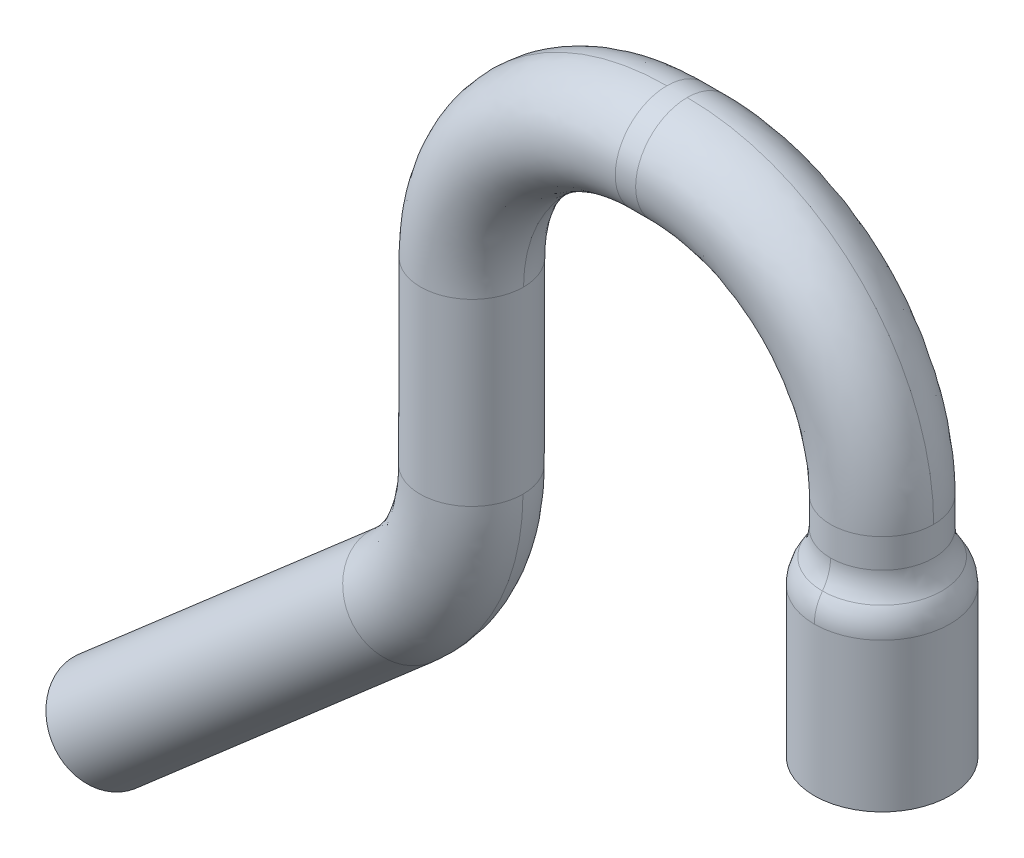
ISO-10303-21;
HEADER;
FILE_DESCRIPTION(('STEP AP214'),'2;1');
FILE_NAME('part.step','',(''),(''),'','','');
FILE_SCHEMA(('AUTOMOTIVE_DESIGN { 1 0 10303 214 1 1 1 1 }'));
ENDSEC;
DATA;
#1=APPLICATION_CONTEXT('core data for automotive mechanical design processes');
#2=APPLICATION_PROTOCOL_DEFINITION('international standard','automotive_design',2000,#1);
#3=PRODUCT_CONTEXT('',#1,'mechanical');
#4=PRODUCT('Part','Part','',(#3));
#5=PRODUCT_RELATED_PRODUCT_CATEGORY('part','',(#4));
#6=PRODUCT_DEFINITION_FORMATION('','',#4);
#7=PRODUCT_DEFINITION_CONTEXT('part definition',#1,'design');
#8=PRODUCT_DEFINITION('design','',#6,#7);
#9=PRODUCT_DEFINITION_SHAPE('','',#8);
#10=(LENGTH_UNIT() NAMED_UNIT(*) SI_UNIT(.MILLI.,.METRE.));
#11=(NAMED_UNIT(*) PLANE_ANGLE_UNIT() SI_UNIT($,.RADIAN.));
#12=(NAMED_UNIT(*) SI_UNIT($,.STERADIAN.) SOLID_ANGLE_UNIT());
#13=UNCERTAINTY_MEASURE_WITH_UNIT(LENGTH_MEASURE(1.E-05),#10,'distance_accuracy_value','');
#14=(GEOMETRIC_REPRESENTATION_CONTEXT(3) GLOBAL_UNCERTAINTY_ASSIGNED_CONTEXT((#13)) GLOBAL_UNIT_ASSIGNED_CONTEXT((#10,
#11,#12)) REPRESENTATION_CONTEXT('',''));
#15=CARTESIAN_POINT('',(0.,0.,0.));
#16=DIRECTION('',(0.,0.,1.));
#17=DIRECTION('',(1.,0.,0.));
#18=AXIS2_PLACEMENT_3D('',#15,#16,#17);
#19=CARTESIAN_POINT('',(-3.2131,155.5,3.2131));
#20=DIRECTION('',(0.,-1.,0.));
#21=DIRECTION('',(0.,0.,-1.));
#22=AXIS2_PLACEMENT_3D('',#19,#20,#21);
#23=PLANE('',#22);
#24=CARTESIAN_POINT('',(0.,155.5,0.));
#25=DIRECTION('',(0.,-1.,0.));
#26=DIRECTION('',(1.,0.,0.));
#27=AXIS2_PLACEMENT_3D('',#24,#25,#26);
#28=CIRCLE('',#27,3.175);
#29=CARTESIAN_POINT('',(3.175,155.5,0.));
#30=VERTEX_POINT('',#29);
#31=EDGE_CURVE('E20',#30,#30,#28,.F.);
#32=ORIENTED_EDGE('',*,*,#31,.F.);
#33=EDGE_LOOP('',(#32));
#34=FACE_BOUND('',#33,.T.);
#35=ADVANCED_FACE('F16',(#34),#23,.T.);
#36=CARTESIAN_POINT('',(0.,155.5,0.));
#37=DIRECTION('',(0.,-1.,0.));
#38=DIRECTION('',(1.,0.,0.));
#39=AXIS2_PLACEMENT_3D('',#36,#37,#38);
#40=CYLINDRICAL_SURFACE('',#39,3.175);
#41=CARTESIAN_POINT('',(0.,145.34,0.));
#42=DIRECTION('',(0.,-1.,0.));
#43=DIRECTION('',(1.,0.,0.));
#44=AXIS2_PLACEMENT_3D('',#41,#42,#43);
#45=CIRCLE('',#44,3.175);
#46=CARTESIAN_POINT('',(3.17499999999996,145.34,0.));
#47=VERTEX_POINT('',#46);
#48=EDGE_CURVE('E234',#47,#47,#45,.F.);
#49=ORIENTED_EDGE('',*,*,#48,.F.);
#50=EDGE_LOOP('',(#49));
#51=FACE_BOUND('',#50,.T.);
#52=ORIENTED_EDGE('',*,*,#31,.T.);
#53=EDGE_LOOP('',(#52));
#54=FACE_BOUND('',#53,.T.);
#55=ADVANCED_FACE('F241',(#51,#54),#40,.F.);
#56=CARTESIAN_POINT('',(-45.580783155,120.962388714,-3.2131));
#57=DIRECTION('',(-0.754889393600619,-0.65585212009209,0.));
#58=DIRECTION('',(0.,0.,1.));
#59=AXIS2_PLACEMENT_3D('',#56,#57,#58);
#60=PLANE('',#59);
#61=CARTESIAN_POINT('',(-47.6881016022959,123.387923824684,0.));
#62=DIRECTION('',(-0.75488939360039,-0.655852120092354,0.));
#63=DIRECTION('',(0.655852120092354,-0.75488939360039,0.));
#64=AXIS2_PLACEMENT_3D('',#61,#62,#63);
#65=CIRCLE('',#64,3.17500000035412);
#66=CARTESIAN_POINT('',(-45.6057711207704,120.991149999736,0.));
#67=VERTEX_POINT('',#66);
#68=EDGE_CURVE('E232',#67,#67,#65,.T.);
#69=ORIENTED_EDGE('',*,*,#68,.T.);
#70=EDGE_LOOP('',(#69));
#71=FACE_BOUND('',#70,.T.);
#72=ADVANCED_FACE('F249',(#71),#60,.T.);
#73=CARTESIAN_POINT('',(-4.2251,145.34,4.2251));
#74=DIRECTION('',(0.,-1.,0.));
#75=DIRECTION('',(0.,0.,-1.));
#76=AXIS2_PLACEMENT_3D('',#73,#74,#75);
#77=PLANE('',#76);
#78=ORIENTED_EDGE('',*,*,#48,.T.);
#79=EDGE_LOOP('',(#78));
#80=FACE_BOUND('',#79,.T.);
#81=CARTESIAN_POINT('',(0.,145.34,0.));
#82=DIRECTION('',(0.,1.,0.));
#83=DIRECTION('',(0.,0.,1.));
#84=AXIS2_PLACEMENT_3D('',#81,#82,#83);
#85=CIRCLE('',#84,4.175);
#86=CARTESIAN_POINT('',(0.,145.34,4.175));
#87=VERTEX_POINT('',#86);
#88=EDGE_CURVE('E229',#87,#87,#85,.F.);
#89=ORIENTED_EDGE('',*,*,#88,.T.);
#90=EDGE_LOOP('',(#89));
#91=FACE_BOUND('',#90,.T.);
#92=ADVANCED_FACE('F18',(#80,#91),#77,.T.);
#93=CARTESIAN_POINT('',(-29.415786223755,139.263013449213,0.));
#94=DIRECTION('',(-0.75488939360039,-0.655852120092354,0.));
#95=DIRECTION('',(0.655852120092354,-0.75488939360039,0.));
#96=AXIS2_PLACEMENT_3D('',#93,#94,#95);
#97=CYLINDRICAL_SURFACE('',#96,3.17500000035412);
#98=ORIENTED_EDGE('',*,*,#68,.F.);
#99=EDGE_LOOP('',(#98));
#100=FACE_BOUND('',#99,.T.);
#101=CARTESIAN_POINT('',(-29.415786223755,139.263013449213,0.));
#102=DIRECTION('',(-0.75488939360039,-0.655852120092354,0.));
#103=DIRECTION('',(0.655852120092354,-0.75488939360039,0.));
#104=AXIS2_PLACEMENT_3D('',#101,#102,#103);
#105=CIRCLE('',#104,3.17500000035412);
#106=CARTESIAN_POINT('',(-31.4981167053953,141.659787274293,1.10533916085306E-09));
#107=VERTEX_POINT('',#106);
#108=CARTESIAN_POINT('',(-27.333455743097,136.866239623137,1.47144834127353E-09));
#109=VERTEX_POINT('',#108);
#110=EDGE_CURVE('E198',#107,#109,#105,.F.);
#111=ORIENTED_EDGE('',*,*,#110,.F.);
#112=CARTESIAN_POINT('',(-29.4157862237551,139.263013449213,0.));
#113=DIRECTION('',(-0.75488939360039,-0.655852120092354,0.));
#114=DIRECTION('',(0.655852120092354,-0.75488939360039,0.));
#115=AXIS2_PLACEMENT_3D('',#112,#113,#114);
#116=CIRCLE('',#115,3.17500000035412);
#117=EDGE_CURVE('E58',#109,#107,#116,.F.);
#118=ORIENTED_EDGE('',*,*,#117,.F.);
#119=EDGE_LOOP('',(#111,#118));
#120=FACE_BOUND('',#119,.T.);
#121=ADVANCED_FACE('F372',(#100,#120),#97,.T.);
#122=CARTESIAN_POINT('',(0.,145.34,0.));
#123=DIRECTION('',(0.,1.,0.));
#124=DIRECTION('',(0.,0.,1.));
#125=AXIS2_PLACEMENT_3D('',#122,#123,#124);
#126=CYLINDRICAL_SURFACE('',#125,4.175);
#127=ORIENTED_EDGE('',*,*,#88,.F.);
#128=EDGE_LOOP('',(#127));
#129=FACE_BOUND('',#128,.T.);
#130=CARTESIAN_POINT('',(0.,154.493351798,0.));
#131=DIRECTION('',(0.,1.,0.));
#132=DIRECTION('',(0.,0.,1.));
#133=AXIS2_PLACEMENT_3D('',#130,#131,#132);
#134=CIRCLE('',#133,4.175);
#135=CARTESIAN_POINT('',(-1.8744419934498E-10,154.493351798,4.175));
#136=VERTEX_POINT('',#135);
#137=CARTESIAN_POINT('',(-4.28153407025754E-10,154.493351798,-4.175));
#138=VERTEX_POINT('',#137);
#139=EDGE_CURVE('E70',#136,#138,#134,.T.);
#140=ORIENTED_EDGE('',*,*,#139,.F.);
#141=CARTESIAN_POINT('',(0.,154.493351798,0.));
#142=DIRECTION('',(0.,1.,0.));
#143=DIRECTION('',(0.,0.,1.));
#144=AXIS2_PLACEMENT_3D('',#141,#142,#143);
#145=CIRCLE('',#144,4.175);
#146=EDGE_CURVE('E166',#138,#136,#145,.T.);
#147=ORIENTED_EDGE('',*,*,#146,.F.);
#148=EDGE_LOOP('',(#140,#147));
#149=FACE_BOUND('',#148,.T.);
#150=ADVANCED_FACE('F364',(#129,#149),#126,.T.);
#151=CARTESIAN_POINT('',(-28.445187319,148.29596033,0.316971098));
#152=CARTESIAN_POINT('',(-28.452728914,145.7042505,0.316971098));
#153=CARTESIAN_POINT('',(-29.531251181,143.34759897,0.316971098));
#154=CARTESIAN_POINT('',(-31.487713726,141.647813388,0.316971098));
#155=CARTESIAN_POINT('',(-28.645936128,148.296544487,-1.683829374));
#156=CARTESIAN_POINT('',(-28.653306476,145.763684675,-1.683829374));
#157=CARTESIAN_POINT('',(-29.707338713,143.460545687,-1.683829374));
#158=CARTESIAN_POINT('',(-31.619375816,141.799357176,-1.683829374));
#159=CARTESIAN_POINT('',(-27.296900284,148.292618939,-3.175));
#160=CARTESIAN_POINT('',(-27.305421416,145.364285885,-3.175));
#161=CARTESIAN_POINT('',(-28.524027129,142.701541587,-3.175));
#162=CARTESIAN_POINT('',(-30.734604051,140.780980014,-3.175));
#163=CARTESIAN_POINT('',(-25.286062469,148.286767618,-3.175));
#164=CARTESIAN_POINT('',(-25.296298931,144.768952416,-3.175));
#165=CARTESIAN_POINT('',(-26.760213596,141.570189775,-3.175));
#166=CARTESIAN_POINT('',(-29.415786224,139.263013449,-3.175));
#167=CARTESIAN_POINT('',(-23.275224655,148.280916298,-3.175));
#168=CARTESIAN_POINT('',(-23.287176445,144.173618947,-3.175));
#169=CARTESIAN_POINT('',(-24.996400063,140.438837963,-3.175));
#170=CARTESIAN_POINT('',(-28.096968396,137.745046884,-3.175));
#171=CARTESIAN_POINT('',(-21.92618881,148.276990749,-1.683829374));
#172=CARTESIAN_POINT('',(-21.939291385,143.774220158,-1.683829374));
#173=CARTESIAN_POINT('',(-23.813088479,139.679833863,-1.683829374));
#174=CARTESIAN_POINT('',(-27.212196632,136.726669721,-1.683829374));
#175=CARTESIAN_POINT('',(-22.126937619,148.277574907,0.316971098));
#176=CARTESIAN_POINT('',(-22.139868947,143.833654332,0.316971098));
#177=CARTESIAN_POINT('',(-23.989176011,139.79278058,0.316971098));
#178=CARTESIAN_POINT('',(-27.343858721,136.87821351,0.316971098));
#179=(BOUNDED_SURFACE() B_SPLINE_SURFACE(3,3,((#151,#152,#153,#154),(#155,#156,#157,#158),(#159,
#160,#161,#162),(#163,#164,#165,#166),(#167,#168,#169,#170),(#171,#172,#173,#174),(#175,#176,
#177,#178)),.UNSPECIFIED.,.F.,.F.,.F.) B_SPLINE_SURFACE_WITH_KNOTS((4,3,4),(4,4),(0.,0.5,1.),
(0.,1.),.UNSPECIFIED.) GEOMETRIC_REPRESENTATION_ITEM() RATIONAL_B_SPLINE_SURFACE(((1.,
0.940337997524147,0.940337997524147,1.),(0.780588314885162,0.734016852909862,0.734016852909862,
0.780588314885162),(0.780588314885162,0.734016852909862,0.734016852909862,0.780588314885162),
(1.,0.940337997524147,0.940337997524147,1.),(0.780588314885162,0.734016852909862,
0.734016852909862,0.780588314885162),(0.780588314885162,0.734016852909862,0.734016852909862,
0.780588314885162),(1.,0.940337997524147,0.940337997524147,1.))) REPRESENTATION_ITEM('') SURFACE());
#180=CARTESIAN_POINT('',(-28.4610490270392,148.29600648581,3.51308509306732E-09));
#181=CARTESIAN_POINT('',(-28.4685770913588,145.708946555469,3.51308520727076E-09));
#182=CARTESIAN_POINT('',(-29.5451643346998,143.356523196571,3.51308520727076E-09));
#183=CARTESIAN_POINT('',(-31.4981167049706,141.659787273812,3.51308509306732E-09));
#184=(BOUNDED_CURVE() B_SPLINE_CURVE(3,(#180,#181,#182,#183),.UNSPECIFIED.,.F.,
.F.) B_SPLINE_CURVE_WITH_KNOTS((4,4),(0.,1.),
.UNSPECIFIED.) CURVE() GEOMETRIC_REPRESENTATION_ITEM() RATIONAL_B_SPLINE_CURVE((0.959415081908988,
0.902174456916763,0.902174456916763,0.959415081908988)) REPRESENTATION_ITEM(''));
#185=CARTESIAN_POINT('',(-28.4610490268485,148.296006485797,-9.85338050116925E-11));
#186=VERTEX_POINT('',#185);
#187=EDGE_CURVE('E195',#186,#107,#184,.T.);
#188=CARTESIAN_POINT('',(-25.2860624688925,148.286767618396,0.));
#189=DIRECTION('',(-0.00290987949499912,-0.9999957662917,0.));
#190=DIRECTION('',(0.9999957662917,-0.0029098794949969,0.));
#191=AXIS2_PLACEMENT_3D('',#188,#189,#190);
#192=CIRCLE('',#191,3.17499999991633);
#193=CARTESIAN_POINT('',(-22.111075911083,148.277528751,7.35724170656422E-10));
#194=VERTEX_POINT('',#193);
#195=EDGE_CURVE('E165',#186,#194,#192,.T.);
#196=CARTESIAN_POINT('',(-37.2860116662722,148.321686171915,3.51308493957697E-09));
#197=DIRECTION('',(0.,0.,1.));
#198=DIRECTION('',(1.,0.,0.));
#199=AXIS2_PLACEMENT_3D('',#196,#197,#198);
#200=CIRCLE('',#199,15.1750000014623);
#201=EDGE_CURVE('E199',#109,#194,#200,.T.);
#202=ORIENTED_EDGE('',*,*,#117,.T.);
#203=ORIENTED_EDGE('',*,*,#187,.F.);
#204=ORIENTED_EDGE('',*,*,#195,.T.);
#205=ORIENTED_EDGE('',*,*,#201,.F.);
#206=EDGE_LOOP('',(#202,#203,#204,#205));
#207=FACE_BOUND('',#206,.T.);
#208=ADVANCED_FACE('F353',(#207),#179,.T.);
#209=CARTESIAN_POINT('',(-22.126937619,148.277574907,-0.316971098));
#210=CARTESIAN_POINT('',(-22.139868947,143.833654332,-0.316971098));
#211=CARTESIAN_POINT('',(-23.989176011,139.79278058,-0.316971098));
#212=CARTESIAN_POINT('',(-27.343858721,136.87821351,-0.316971098));
#213=CARTESIAN_POINT('',(-21.92618881,148.276990749,1.683829374));
#214=CARTESIAN_POINT('',(-21.939291385,143.774220158,1.683829374));
#215=CARTESIAN_POINT('',(-23.813088479,139.679833863,1.683829374));
#216=CARTESIAN_POINT('',(-27.212196632,136.726669721,1.683829374));
#217=CARTESIAN_POINT('',(-23.275224655,148.280916298,3.175));
#218=CARTESIAN_POINT('',(-23.287176445,144.173618947,3.175));
#219=CARTESIAN_POINT('',(-24.996400063,140.438837963,3.175));
#220=CARTESIAN_POINT('',(-28.096968396,137.745046884,3.175));
#221=CARTESIAN_POINT('',(-25.286062469,148.286767618,3.175));
#222=CARTESIAN_POINT('',(-25.296298931,144.768952416,3.175));
#223=CARTESIAN_POINT('',(-26.760213596,141.570189775,3.175));
#224=CARTESIAN_POINT('',(-29.415786224,139.263013449,3.175));
#225=CARTESIAN_POINT('',(-27.296900284,148.292618939,3.175));
#226=CARTESIAN_POINT('',(-27.305421416,145.364285885,3.175));
#227=CARTESIAN_POINT('',(-28.524027129,142.701541587,3.175));
#228=CARTESIAN_POINT('',(-30.734604051,140.780980014,3.175));
#229=CARTESIAN_POINT('',(-28.645936128,148.296544487,1.683829374));
#230=CARTESIAN_POINT('',(-28.653306476,145.763684675,1.683829374));
#231=CARTESIAN_POINT('',(-29.707338713,143.460545687,1.683829374));
#232=CARTESIAN_POINT('',(-31.619375816,141.799357176,1.683829374));
#233=CARTESIAN_POINT('',(-28.445187319,148.29596033,-0.316971098));
#234=CARTESIAN_POINT('',(-28.452728914,145.7042505,-0.316971098));
#235=CARTESIAN_POINT('',(-29.531251181,143.34759897,-0.316971098));
#236=CARTESIAN_POINT('',(-31.487713726,141.647813388,-0.316971098));
#237=(BOUNDED_SURFACE() B_SPLINE_SURFACE(3,3,((#209,#210,#211,#212),(#213,#214,#215,#216),(#217,
#218,#219,#220),(#221,#222,#223,#224),(#225,#226,#227,#228),(#229,#230,#231,#232),(#233,#234,
#235,#236)),.UNSPECIFIED.,.F.,.F.,.F.) B_SPLINE_SURFACE_WITH_KNOTS((4,3,4),(4,4),(0.,0.5,1.),
(0.,1.),.UNSPECIFIED.) GEOMETRIC_REPRESENTATION_ITEM() RATIONAL_B_SPLINE_SURFACE(((1.,
0.940337997524147,0.940337997524147,1.),(0.780588314885162,0.734016852909862,0.734016852909862,
0.780588314885162),(0.780588314885162,0.734016852909862,0.734016852909862,0.780588314885162),
(1.,0.940337997524147,0.940337997524147,1.),(0.780588314885162,0.734016852909862,
0.734016852909862,0.780588314885162),(0.780588314885162,0.734016852909862,0.734016852909862,
0.780588314885162),(1.,0.940337997524147,0.940337997524147,1.))) REPRESENTATION_ITEM('') SURFACE());
#238=CARTESIAN_POINT('',(-25.2860624688925,148.286767618396,0.));
#239=DIRECTION('',(-0.00290987949499912,-0.9999957662917,0.));
#240=DIRECTION('',(0.9999957662917,-0.0029098794949969,0.));
#241=AXIS2_PLACEMENT_3D('',#238,#239,#240);
#242=CIRCLE('',#241,3.17499999991633);
#243=EDGE_CURVE('E159',#194,#186,#242,.T.);
#244=ORIENTED_EDGE('',*,*,#187,.T.);
#245=ORIENTED_EDGE('',*,*,#110,.T.);
#246=ORIENTED_EDGE('',*,*,#201,.T.);
#247=ORIENTED_EDGE('',*,*,#243,.T.);
#248=EDGE_LOOP('',(#244,#245,#246,#247));
#249=FACE_BOUND('',#248,.T.);
#250=ADVANCED_FACE('F343',(#249),#237,.T.);
#251=CARTESIAN_POINT('',(0.,156.006626393,3.675));
#252=CARTESIAN_POINT('',(7.35,156.006626393,3.675));
#253=CARTESIAN_POINT('',(7.35,156.006626393,-3.675));
#254=CARTESIAN_POINT('',(0.,156.006626393,-3.675));
#255=CARTESIAN_POINT('',(0.,155.565095373,4.002528272));
#256=CARTESIAN_POINT('',(8.005056544,155.565095373,4.002528272));
#257=CARTESIAN_POINT('',(8.005056544,155.565095373,-4.002528272));
#258=CARTESIAN_POINT('',(0.,155.565095373,-4.002528272));
#259=CARTESIAN_POINT('',(0.,155.043101204,4.175));
#260=CARTESIAN_POINT('',(8.35,155.043101204,4.175));
#261=CARTESIAN_POINT('',(8.35,155.043101204,-4.175));
#262=CARTESIAN_POINT('',(0.,155.043101204,-4.175));
#263=CARTESIAN_POINT('',(0.,154.493351798,4.175));
#264=CARTESIAN_POINT('',(8.35,154.493351798,4.175));
#265=CARTESIAN_POINT('',(8.35,154.493351798,-4.175));
#266=CARTESIAN_POINT('',(0.,154.493351798,-4.175));
#267=(BOUNDED_SURFACE() B_SPLINE_SURFACE(3,3,((#251,#252,#253,#254),(#255,#256,#257,#258),(#259,
#260,#261,#262),(#263,#264,#265,#266)),.UNSPECIFIED.,.F.,.F.,
.F.) B_SPLINE_SURFACE_WITH_KNOTS((4,4),(4,4),(0.,1.),(0.,1.),
.UNSPECIFIED.) GEOMETRIC_REPRESENTATION_ITEM() RATIONAL_B_SPLINE_SURFACE(((1.,0.333333333333333,
0.333333333333333,1.),(0.966341952951531,0.322113984317177,0.322113984317177,0.966341952951531),
(0.966341952951531,0.322113984317177,0.322113984317177,0.966341952951531),(1.,0.333333333333333,
0.333333333333333,1.))) REPRESENTATION_ITEM('') SURFACE());
#268=CARTESIAN_POINT('',(0.,156.006626392296,0.));
#269=DIRECTION('',(0.,-1.,0.));
#270=DIRECTION('',(1.,0.,0.));
#271=AXIS2_PLACEMENT_3D('',#268,#269,#270);
#272=CIRCLE('',#271,3.67500000003533);
#273=CARTESIAN_POINT('',(0.,156.006626392473,-3.67500000002567));
#274=VERTEX_POINT('',#273);
#275=CARTESIAN_POINT('',(0.,156.006626392473,3.67500000002567));
#276=VERTEX_POINT('',#275);
#277=EDGE_CURVE('E150',#274,#276,#272,.T.);
#278=CARTESIAN_POINT('',(0.,156.006626393,3.675));
#279=CARTESIAN_POINT('',(0.,155.565095373,4.002528272));
#280=CARTESIAN_POINT('',(0.,155.043101204,4.175));
#281=CARTESIAN_POINT('',(0.,154.493351798,4.175));
#282=(BOUNDED_CURVE() B_SPLINE_CURVE(3,(#278,#279,#280,#281),.UNSPECIFIED.,.F.,
.F.) B_SPLINE_CURVE_WITH_KNOTS((4,4),(0.,1.),
.UNSPECIFIED.) CURVE() GEOMETRIC_REPRESENTATION_ITEM() RATIONAL_B_SPLINE_CURVE((1.,
0.966341952951531,0.966341952951531,1.)) REPRESENTATION_ITEM(''));
#283=EDGE_CURVE('E162',#136,#276,#282,.F.);
#284=CARTESIAN_POINT('',(0.,156.006626393,-3.675));
#285=CARTESIAN_POINT('',(0.,155.565095373,-4.002528272));
#286=CARTESIAN_POINT('',(0.,155.043101204,-4.175));
#287=CARTESIAN_POINT('',(0.,154.493351798,-4.175));
#288=(BOUNDED_CURVE() B_SPLINE_CURVE(3,(#284,#285,#286,#287),.UNSPECIFIED.,.F.,
.F.) B_SPLINE_CURVE_WITH_KNOTS((4,4),(0.,1.),
.UNSPECIFIED.) CURVE() GEOMETRIC_REPRESENTATION_ITEM() RATIONAL_B_SPLINE_CURVE((1.,
0.966341952951531,0.966341952951531,1.)) REPRESENTATION_ITEM(''));
#289=EDGE_CURVE('E178',#274,#138,#288,.T.);
#290=ORIENTED_EDGE('',*,*,#277,.T.);
#291=ORIENTED_EDGE('',*,*,#283,.F.);
#292=ORIENTED_EDGE('',*,*,#139,.T.);
#293=ORIENTED_EDGE('',*,*,#289,.F.);
#294=EDGE_LOOP('',(#290,#291,#292,#293));
#295=FACE_BOUND('',#294,.T.);
#296=ADVANCED_FACE('F332',(#295),#267,.T.);
#297=CARTESIAN_POINT('',(0.,156.006626393,-3.675));
#298=CARTESIAN_POINT('',(-7.35,156.006626393,-3.675));
#299=CARTESIAN_POINT('',(-7.35,156.006626393,3.675));
#300=CARTESIAN_POINT('',(0.,156.006626393,3.675));
#301=CARTESIAN_POINT('',(0.,155.565095373,-4.002528272));
#302=CARTESIAN_POINT('',(-8.005056544,155.565095373,-4.002528272));
#303=CARTESIAN_POINT('',(-8.005056544,155.565095373,4.002528272));
#304=CARTESIAN_POINT('',(0.,155.565095373,4.002528272));
#305=CARTESIAN_POINT('',(0.,155.043101204,-4.175));
#306=CARTESIAN_POINT('',(-8.35,155.043101204,-4.175));
#307=CARTESIAN_POINT('',(-8.35,155.043101204,4.175));
#308=CARTESIAN_POINT('',(0.,155.043101204,4.175));
#309=CARTESIAN_POINT('',(0.,154.493351798,-4.175));
#310=CARTESIAN_POINT('',(-8.35,154.493351798,-4.175));
#311=CARTESIAN_POINT('',(-8.35,154.493351798,4.175));
#312=CARTESIAN_POINT('',(0.,154.493351798,4.175));
#313=(BOUNDED_SURFACE() B_SPLINE_SURFACE(3,3,((#297,#298,#299,#300),(#301,#302,#303,#304),(#305,
#306,#307,#308),(#309,#310,#311,#312)),.UNSPECIFIED.,.F.,.F.,
.F.) B_SPLINE_SURFACE_WITH_KNOTS((4,4),(4,4),(0.,1.),(0.,1.),
.UNSPECIFIED.) GEOMETRIC_REPRESENTATION_ITEM() RATIONAL_B_SPLINE_SURFACE(((1.,0.333333333333333,
0.333333333333333,1.),(0.966341952951531,0.322113984317177,0.322113984317177,0.966341952951531),
(0.966341952951531,0.322113984317177,0.322113984317177,0.966341952951531),(1.,0.333333333333333,
0.333333333333333,1.))) REPRESENTATION_ITEM('') SURFACE());
#314=CARTESIAN_POINT('',(0.,156.006626392296,0.));
#315=DIRECTION('',(0.,-1.,0.));
#316=DIRECTION('',(1.,0.,0.));
#317=AXIS2_PLACEMENT_3D('',#314,#315,#316);
#318=CIRCLE('',#317,3.67500000003533);
#319=EDGE_CURVE('E136',#276,#274,#318,.T.);
#320=ORIENTED_EDGE('',*,*,#283,.T.);
#321=ORIENTED_EDGE('',*,*,#319,.T.);
#322=ORIENTED_EDGE('',*,*,#289,.T.);
#323=ORIENTED_EDGE('',*,*,#146,.T.);
#324=EDGE_LOOP('',(#320,#321,#322,#323));
#325=FACE_BOUND('',#324,.T.);
#326=ADVANCED_FACE('F326',(#325),#313,.T.);
#327=CARTESIAN_POINT('',(-25.2538844459988,159.344918554397,0.));
#328=DIRECTION('',(-0.00290987949499558,-0.9999957662917,0.));
#329=DIRECTION('',(0.9999957662917,-0.00290987949499558,0.));
#330=AXIS2_PLACEMENT_3D('',#327,#328,#329);
#331=CYLINDRICAL_SURFACE('',#330,3.1749999999695);
#332=ORIENTED_EDGE('',*,*,#243,.F.);
#333=ORIENTED_EDGE('',*,*,#195,.F.);
#334=EDGE_LOOP('',(#332,#333));
#335=FACE_BOUND('',#334,.T.);
#336=CARTESIAN_POINT('',(-25.2538844459988,159.344918554397,0.));
#337=DIRECTION('',(-0.00290987949499558,-0.9999957662917,0.));
#338=DIRECTION('',(0.9999957662917,-0.00290987949499558,0.));
#339=AXIS2_PLACEMENT_3D('',#336,#337,#338);
#340=CIRCLE('',#339,3.1749999999695);
#341=CARTESIAN_POINT('',(-28.4288710039721,159.35415742145,1.10533986599536E-09));
#342=VERTEX_POINT('',#341);
#343=CARTESIAN_POINT('',(-22.0788978881531,159.335679686595,1.47144834130807E-09));
#344=VERTEX_POINT('',#343);
#345=EDGE_CURVE('E110',#342,#344,#340,.F.);
#346=ORIENTED_EDGE('',*,*,#345,.F.);
#347=CARTESIAN_POINT('',(-25.2538844459988,159.344918554397,0.));
#348=DIRECTION('',(-0.00290987949499558,-0.9999957662917,0.));
#349=DIRECTION('',(0.9999957662917,-0.00290987949499558,0.));
#350=AXIS2_PLACEMENT_3D('',#347,#348,#349);
#351=CIRCLE('',#350,3.1749999999695);
#352=EDGE_CURVE('E126',#344,#342,#351,.F.);
#353=ORIENTED_EDGE('',*,*,#352,.F.);
#354=EDGE_LOOP('',(#346,#353));
#355=FACE_BOUND('',#354,.T.);
#356=ADVANCED_FACE('F317',(#335,#355),#331,.T.);
#357=CARTESIAN_POINT('',(0.,157.773477866,-3.18768942));
#358=CARTESIAN_POINT('',(6.37537884,157.773477866,-3.18768942));
#359=CARTESIAN_POINT('',(6.37537884,157.773477866,3.18768942));
#360=CARTESIAN_POINT('',(0.,157.773477866,3.18768942));
#361=CARTESIAN_POINT('',(0.,157.045826202,-3.114680729));
#362=CARTESIAN_POINT('',(6.229361458,157.045826202,-3.114680729));
#363=CARTESIAN_POINT('',(6.229361458,157.045826202,3.114680729));
#364=CARTESIAN_POINT('',(0.,157.045826202,3.114680729));
#365=CARTESIAN_POINT('',(0.,156.351442512,-3.344111558));
#366=CARTESIAN_POINT('',(6.688223116,156.351442512,-3.344111558));
#367=CARTESIAN_POINT('',(6.688223116,156.351442512,3.344111558));
#368=CARTESIAN_POINT('',(0.,156.351442512,3.344111558));
#369=CARTESIAN_POINT('',(0.,155.810526292,-3.836266876));
#370=CARTESIAN_POINT('',(7.672533752,155.810526292,-3.836266876));
#371=CARTESIAN_POINT('',(7.672533752,155.810526292,3.836266876));
#372=CARTESIAN_POINT('',(0.,155.810526292,3.836266876));
#373=(BOUNDED_SURFACE() B_SPLINE_SURFACE(3,3,((#357,#358,#359,#360),(#361,#362,#363,#364),(#365,
#366,#367,#368),(#369,#370,#371,#372)),.UNSPECIFIED.,.F.,.F.,
.F.) B_SPLINE_SURFACE_WITH_KNOTS((4,4),(4,4),(0.,1.),(0.,1.),
.UNSPECIFIED.) GEOMETRIC_REPRESENTATION_ITEM() RATIONAL_B_SPLINE_SURFACE(((1.,0.333333333333333,
0.333333333333333,1.),(0.942299194236389,0.31409973141213,0.31409973141213,0.942299194236389),
(0.942299194236389,0.31409973141213,0.31409973141213,0.942299194236389),(1.,0.333333333333333,
0.333333333333333,1.))) REPRESENTATION_ITEM('') SURFACE());
#374=CARTESIAN_POINT('',(0.,157.773477866,-3.18768942));
#375=CARTESIAN_POINT('',(0.,157.045826202,-3.114680729));
#376=CARTESIAN_POINT('',(0.,156.351442512,-3.344111558));
#377=CARTESIAN_POINT('',(0.,155.810526292,-3.836266876));
#378=(BOUNDED_CURVE() B_SPLINE_CURVE(3,(#374,#375,#376,#377),.UNSPECIFIED.,.F.,
.F.) B_SPLINE_CURVE_WITH_KNOTS((4,4),(0.,1.),
.UNSPECIFIED.) CURVE() GEOMETRIC_REPRESENTATION_ITEM() RATIONAL_B_SPLINE_CURVE((1.,
0.942299194236389,0.942299194236389,1.)) REPRESENTATION_ITEM(''));
#379=CARTESIAN_POINT('',(-8.14260117665278E-10,157.519900987951,-3.17499999994991));
#380=VERTEX_POINT('',#379);
#381=EDGE_CURVE('E137',#274,#380,#378,.F.);
#382=CARTESIAN_POINT('',(0.,157.519900988,0.));
#383=DIRECTION('',(0.,-1.,0.));
#384=DIRECTION('',(1.,0.,0.));
#385=AXIS2_PLACEMENT_3D('',#382,#383,#384);
#386=CIRCLE('',#385,3.175);
#387=CARTESIAN_POINT('',(-4.34135366544908E-10,157.519900987998,3.17499999994991));
#388=VERTEX_POINT('',#387);
#389=EDGE_CURVE('E111',#380,#388,#386,.T.);
#390=CARTESIAN_POINT('',(0.,157.773477866,3.18768942));
#391=CARTESIAN_POINT('',(0.,157.045826202,3.114680729));
#392=CARTESIAN_POINT('',(0.,156.351442512,3.344111558));
#393=CARTESIAN_POINT('',(0.,155.810526292,3.836266876));
#394=(BOUNDED_CURVE() B_SPLINE_CURVE(3,(#390,#391,#392,#393),.UNSPECIFIED.,.F.,
.F.) B_SPLINE_CURVE_WITH_KNOTS((4,4),(0.,1.),
.UNSPECIFIED.) CURVE() GEOMETRIC_REPRESENTATION_ITEM() RATIONAL_B_SPLINE_CURVE((1.,
0.942299194236389,0.942299194236389,1.)) REPRESENTATION_ITEM(''));
#395=EDGE_CURVE('E133',#388,#276,#394,.T.);
#396=ORIENTED_EDGE('',*,*,#277,.F.);
#397=ORIENTED_EDGE('',*,*,#381,.T.);
#398=ORIENTED_EDGE('',*,*,#389,.T.);
#399=ORIENTED_EDGE('',*,*,#395,.T.);
#400=EDGE_LOOP('',(#396,#397,#398,#399));
#401=FACE_BOUND('',#400,.T.);
#402=ADVANCED_FACE('F306',(#401),#373,.F.);
#403=CARTESIAN_POINT('',(0.,157.773477866,3.18768942));
#404=CARTESIAN_POINT('',(-6.37537884,157.773477866,3.18768942));
#405=CARTESIAN_POINT('',(-6.37537884,157.773477866,-3.18768942));
#406=CARTESIAN_POINT('',(0.,157.773477866,-3.18768942));
#407=CARTESIAN_POINT('',(0.,157.045826202,3.114680729));
#408=CARTESIAN_POINT('',(-6.229361458,157.045826202,3.114680729));
#409=CARTESIAN_POINT('',(-6.229361458,157.045826202,-3.114680729));
#410=CARTESIAN_POINT('',(0.,157.045826202,-3.114680729));
#411=CARTESIAN_POINT('',(0.,156.351442512,3.344111558));
#412=CARTESIAN_POINT('',(-6.688223116,156.351442512,3.344111558));
#413=CARTESIAN_POINT('',(-6.688223116,156.351442512,-3.344111558));
#414=CARTESIAN_POINT('',(0.,156.351442512,-3.344111558));
#415=CARTESIAN_POINT('',(0.,155.810526292,3.836266876));
#416=CARTESIAN_POINT('',(-7.672533752,155.810526292,3.836266876));
#417=CARTESIAN_POINT('',(-7.672533752,155.810526292,-3.836266876));
#418=CARTESIAN_POINT('',(0.,155.810526292,-3.836266876));
#419=(BOUNDED_SURFACE() B_SPLINE_SURFACE(3,3,((#403,#404,#405,#406),(#407,#408,#409,#410),(#411,
#412,#413,#414),(#415,#416,#417,#418)),.UNSPECIFIED.,.F.,.F.,
.F.) B_SPLINE_SURFACE_WITH_KNOTS((4,4),(4,4),(0.,1.),(0.,1.),
.UNSPECIFIED.) GEOMETRIC_REPRESENTATION_ITEM() RATIONAL_B_SPLINE_SURFACE(((1.,0.333333333333333,
0.333333333333333,1.),(0.942299194236389,0.31409973141213,0.31409973141213,0.942299194236389),
(0.942299194236389,0.31409973141213,0.31409973141213,0.942299194236389),(1.,0.333333333333333,
0.333333333333333,1.))) REPRESENTATION_ITEM('') SURFACE());
#420=CARTESIAN_POINT('',(0.,157.519900988,0.));
#421=DIRECTION('',(0.,-1.,0.));
#422=DIRECTION('',(1.,0.,0.));
#423=AXIS2_PLACEMENT_3D('',#420,#421,#422);
#424=CIRCLE('',#423,3.175);
#425=EDGE_CURVE('E105',#388,#380,#424,.T.);
#426=ORIENTED_EDGE('',*,*,#395,.F.);
#427=ORIENTED_EDGE('',*,*,#425,.T.);
#428=ORIENTED_EDGE('',*,*,#381,.F.);
#429=ORIENTED_EDGE('',*,*,#319,.F.);
#430=EDGE_LOOP('',(#426,#427,#428,#429));
#431=FACE_BOUND('',#430,.T.);
#432=ADVANCED_FACE('F296',(#431),#419,.F.);
#433=CARTESIAN_POINT('',(-13.253935251,174.469138225,0.316971098));
#434=CARTESIAN_POINT('',(-22.113478165,174.469138225,0.316971098));
#435=CARTESIAN_POINT('',(-28.387229094,168.21361667,0.316971098));
#436=CARTESIAN_POINT('',(-28.413009296,159.354111265,0.316971098));
#437=CARTESIAN_POINT('',(-13.253935251,174.669887884,-1.683829374));
#438=CARTESIAN_POINT('',(-22.23080345,174.669887884,-1.683829374));
#439=CARTESIAN_POINT('',(-28.587636501,168.331525617,-1.683829374));
#440=CARTESIAN_POINT('',(-28.613758106,159.354695423,-1.683829374));
#441=CARTESIAN_POINT('',(-13.253935251,173.320846328,-3.175));
#442=CARTESIAN_POINT('',(-21.442375284,173.320846328,-3.175));
#443=CARTESIAN_POINT('',(-27.240894887,167.53917524,-3.175));
#444=CARTESIAN_POINT('',(-27.264722261,159.350769874,-3.175));
#445=CARTESIAN_POINT('',(-13.253935251,171.31,-3.175));
#446=CARTESIAN_POINT('',(-20.267164723,171.31,-3.175));
#447=CARTESIAN_POINT('',(-25.233476794,166.358118334,-3.175));
#448=CARTESIAN_POINT('',(-25.253884446,159.344918554,-3.175));
#449=CARTESIAN_POINT('',(-13.253935251,169.299153672,-3.175));
#450=CARTESIAN_POINT('',(-19.091954162,169.299153672,-3.175));
#451=CARTESIAN_POINT('',(-23.2260587,165.177061428,-3.175));
#452=CARTESIAN_POINT('',(-23.243046632,159.339067233,-3.175));
#453=CARTESIAN_POINT('',(-13.253935251,167.950112116,-1.683829374));
#454=CARTESIAN_POINT('',(-18.303525995,167.950112116,-1.683829374));
#455=CARTESIAN_POINT('',(-21.879317087,164.384711051,-1.683829374));
#456=CARTESIAN_POINT('',(-21.894010787,159.335141685,-1.683829374));
#457=CARTESIAN_POINT('',(-13.253935251,168.150861775,0.316971098));
#458=CARTESIAN_POINT('',(-18.420851281,168.150861775,0.316971098));
#459=CARTESIAN_POINT('',(-22.079724493,164.502619997,0.316971098));
#460=CARTESIAN_POINT('',(-22.094759596,159.335725842,0.316971098));
#461=(BOUNDED_SURFACE() B_SPLINE_SURFACE(3,3,((#433,#434,#435,#436),(#437,#438,#439,#440),(#441,
#442,#443,#444),(#445,#446,#447,#448),(#449,#450,#451,#452),(#453,#454,#455,#456),(#457,#458,
#459,#460)),.UNSPECIFIED.,.F.,.F.,.F.) B_SPLINE_SURFACE_WITH_KNOTS((4,3,4),(4,4),(0.,0.5,1.),
(0.,1.),.UNSPECIFIED.) GEOMETRIC_REPRESENTATION_ITEM() RATIONAL_B_SPLINE_SURFACE(((1.,
0.805423221077022,0.805423221077022,1.),(0.780588314885162,0.628703954909892,0.628703954909892,
0.780588314885162),(0.780588314885162,0.628703954909892,0.628703954909892,0.780588314885162),
(1.,0.805423221077022,0.805423221077022,1.),(0.780588314885162,0.628703954909893,
0.628703954909893,0.780588314885162),(0.780588314885162,0.628703954909893,0.628703954909893,
0.780588314885162),(1.,0.805423221077022,0.805423221077022,1.))) REPRESENTATION_ITEM('') SURFACE());
#462=CARTESIAN_POINT('',(-13.253935251,159.309999999789,3.51308506267276E-09));
#463=DIRECTION('',(0.,0.,-1.));
#464=DIRECTION('',(0.,1.,0.));
#465=AXIS2_PLACEMENT_3D('',#462,#463,#464);
#466=CIRCLE('',#465,8.82499999972838);
#467=CARTESIAN_POINT('',(-13.253935251,168.134999999839,3.56768623379098E-10));
#468=VERTEX_POINT('',#467);
#469=EDGE_CURVE('E97',#344,#468,#466,.T.);
#470=CARTESIAN_POINT('',(-13.2539352509999,159.309999999917,3.51308479234895E-09));
#471=DIRECTION('',(0.,0.,1.));
#472=DIRECTION('',(0.,-1.,0.));
#473=AXIS2_PLACEMENT_3D('',#470,#471,#472);
#474=CIRCLE('',#473,15.1749999999928);
#475=CARTESIAN_POINT('',(-13.253935251,174.48499999997,7.36892997810866E-10));
#476=VERTEX_POINT('',#475);
#477=EDGE_CURVE('E100',#476,#342,#474,.T.);
#478=CARTESIAN_POINT('',(-13.253935251,171.31,0.));
#479=DIRECTION('',(-1.,0.,0.));
#480=DIRECTION('',(0.,0.,1.));
#481=AXIS2_PLACEMENT_3D('',#478,#479,#480);
#482=CIRCLE('',#481,3.175);
#483=EDGE_CURVE('E94',#476,#468,#482,.T.);
#484=ORIENTED_EDGE('',*,*,#469,.F.);
#485=ORIENTED_EDGE('',*,*,#352,.T.);
#486=ORIENTED_EDGE('',*,*,#477,.F.);
#487=ORIENTED_EDGE('',*,*,#483,.T.);
#488=EDGE_LOOP('',(#484,#485,#486,#487));
#489=FACE_BOUND('',#488,.T.);
#490=ADVANCED_FACE('F96',(#489),#461,.T.);
#491=CARTESIAN_POINT('',(-13.253935251,168.150861775,-0.316971098));
#492=CARTESIAN_POINT('',(-18.420851281,168.150861775,-0.316971098));
#493=CARTESIAN_POINT('',(-22.079724493,164.502619997,-0.316971098));
#494=CARTESIAN_POINT('',(-22.094759596,159.335725842,-0.316971098));
#495=CARTESIAN_POINT('',(-13.253935251,167.950112116,1.683829374));
#496=CARTESIAN_POINT('',(-18.303525995,167.950112116,1.683829374));
#497=CARTESIAN_POINT('',(-21.879317087,164.384711051,1.683829374));
#498=CARTESIAN_POINT('',(-21.894010787,159.335141685,1.683829374));
#499=CARTESIAN_POINT('',(-13.253935251,169.299153672,3.175));
#500=CARTESIAN_POINT('',(-19.091954162,169.299153672,3.175));
#501=CARTESIAN_POINT('',(-23.2260587,165.177061428,3.175));
#502=CARTESIAN_POINT('',(-23.243046632,159.339067233,3.175));
#503=CARTESIAN_POINT('',(-13.253935251,171.31,3.175));
#504=CARTESIAN_POINT('',(-20.267164723,171.31,3.175));
#505=CARTESIAN_POINT('',(-25.233476794,166.358118334,3.175));
#506=CARTESIAN_POINT('',(-25.253884446,159.344918554,3.175));
#507=CARTESIAN_POINT('',(-13.253935251,173.320846328,3.175));
#508=CARTESIAN_POINT('',(-21.442375284,173.320846328,3.175));
#509=CARTESIAN_POINT('',(-27.240894887,167.53917524,3.175));
#510=CARTESIAN_POINT('',(-27.264722261,159.350769874,3.175));
#511=CARTESIAN_POINT('',(-13.253935251,174.669887884,1.683829374));
#512=CARTESIAN_POINT('',(-22.23080345,174.669887884,1.683829374));
#513=CARTESIAN_POINT('',(-28.587636501,168.331525617,1.683829374));
#514=CARTESIAN_POINT('',(-28.613758106,159.354695423,1.683829374));
#515=CARTESIAN_POINT('',(-13.253935251,174.469138225,-0.316971098));
#516=CARTESIAN_POINT('',(-22.113478165,174.469138225,-0.316971098));
#517=CARTESIAN_POINT('',(-28.387229094,168.21361667,-0.316971098));
#518=CARTESIAN_POINT('',(-28.413009296,159.354111265,-0.316971098));
#519=(BOUNDED_SURFACE() B_SPLINE_SURFACE(3,3,((#491,#492,#493,#494),(#495,#496,#497,#498),(#499,
#500,#501,#502),(#503,#504,#505,#506),(#507,#508,#509,#510),(#511,#512,#513,#514),(#515,#516,
#517,#518)),.UNSPECIFIED.,.F.,.F.,.F.) B_SPLINE_SURFACE_WITH_KNOTS((4,3,4),(4,4),(0.,0.5,1.),
(0.,1.),.UNSPECIFIED.) GEOMETRIC_REPRESENTATION_ITEM() RATIONAL_B_SPLINE_SURFACE(((1.,
0.805423221077022,0.805423221077022,1.),(0.780588314885162,0.628703954909893,0.628703954909893,
0.780588314885162),(0.780588314885162,0.628703954909893,0.628703954909893,0.780588314885162),
(1.,0.805423221077022,0.805423221077022,1.),(0.780588314885162,0.628703954909892,
0.628703954909892,0.780588314885162),(0.780588314885162,0.628703954909892,0.628703954909892,
0.780588314885162),(1.,0.805423221077022,0.805423221077022,1.))) REPRESENTATION_ITEM('') SURFACE());
#520=CARTESIAN_POINT('',(-13.253935251,171.31,0.));
#521=DIRECTION('',(-1.,0.,0.));
#522=DIRECTION('',(0.,0.,1.));
#523=AXIS2_PLACEMENT_3D('',#520,#521,#522);
#524=CIRCLE('',#523,3.175);
#525=EDGE_CURVE('E104',#468,#476,#524,.T.);
#526=ORIENTED_EDGE('',*,*,#469,.T.);
#527=ORIENTED_EDGE('',*,*,#525,.T.);
#528=ORIENTED_EDGE('',*,*,#477,.T.);
#529=ORIENTED_EDGE('',*,*,#345,.T.);
#530=EDGE_LOOP('',(#526,#527,#528,#529));
#531=FACE_BOUND('',#530,.T.);
#532=ADVANCED_FACE('F108',(#531),#519,.T.);
#533=CARTESIAN_POINT('',(0.,159.31,0.));
#534=DIRECTION('',(0.,-1.,0.));
#535=DIRECTION('',(0.,0.,-1.));
#536=AXIS2_PLACEMENT_3D('',#533,#534,#535);
#537=CYLINDRICAL_SURFACE('',#536,3.175);
#538=ORIENTED_EDGE('',*,*,#389,.F.);
#539=ORIENTED_EDGE('',*,*,#425,.F.);
#540=EDGE_LOOP('',(#538,#539));
#541=FACE_BOUND('',#540,.T.);
#542=CARTESIAN_POINT('',(0.,159.31,0.));
#543=DIRECTION('',(0.,-1.,0.));
#544=DIRECTION('',(0.,0.,-1.));
#545=AXIS2_PLACEMENT_3D('',#542,#543,#544);
#546=CIRCLE('',#545,3.175);
#547=CARTESIAN_POINT('',(-3.175,159.31,1.10533972603038E-09));
#548=VERTEX_POINT('',#547);
#549=CARTESIAN_POINT('',(3.17500000010022,159.31,1.47144767906609E-09));
#550=VERTEX_POINT('',#549);
#551=EDGE_CURVE('E220',#548,#550,#546,.F.);
#552=ORIENTED_EDGE('',*,*,#551,.F.);
#553=CARTESIAN_POINT('',(0.,159.31,0.));
#554=DIRECTION('',(0.,-1.,0.));
#555=DIRECTION('',(0.,0.,-1.));
#556=AXIS2_PLACEMENT_3D('',#553,#554,#555);
#557=CIRCLE('',#556,3.175);
#558=EDGE_CURVE('E114',#550,#548,#557,.F.);
#559=ORIENTED_EDGE('',*,*,#558,.F.);
#560=EDGE_LOOP('',(#552,#559));
#561=FACE_BOUND('',#560,.T.);
#562=ADVANCED_FACE('F279',(#541,#561),#537,.T.);
#563=CARTESIAN_POINT('',(-12.,171.31,0.));
#564=DIRECTION('',(-1.,0.,0.));
#565=DIRECTION('',(0.,0.,1.));
#566=AXIS2_PLACEMENT_3D('',#563,#564,#565);
#567=CYLINDRICAL_SURFACE('',#566,3.175);
#568=CARTESIAN_POINT('',(-12.,171.31,0.));
#569=DIRECTION('',(-1.,0.,0.));
#570=DIRECTION('',(0.,0.,1.));
#571=AXIS2_PLACEMENT_3D('',#568,#569,#570);
#572=CIRCLE('',#571,3.175);
#573=CARTESIAN_POINT('',(-12.,168.1349999999,1.14584805852048E-09));
#574=VERTEX_POINT('',#573);
#575=CARTESIAN_POINT('',(-12.,174.485,-6.51203385536176E-10));
#576=VERTEX_POINT('',#575);
#577=EDGE_CURVE('E34',#574,#576,#572,.F.);
#578=ORIENTED_EDGE('',*,*,#577,.F.);
#579=CARTESIAN_POINT('',(-12.,171.31,0.));
#580=DIRECTION('',(-1.,0.,0.));
#581=DIRECTION('',(0.,0.,1.));
#582=AXIS2_PLACEMENT_3D('',#579,#580,#581);
#583=CIRCLE('',#582,3.175);
#584=EDGE_CURVE('E26',#576,#574,#583,.F.);
#585=ORIENTED_EDGE('',*,*,#584,.F.);
#586=EDGE_LOOP('',(#578,#585));
#587=FACE_BOUND('',#586,.T.);
#588=ORIENTED_EDGE('',*,*,#483,.F.);
#589=ORIENTED_EDGE('',*,*,#525,.F.);
#590=EDGE_LOOP('',(#588,#589));
#591=FACE_BOUND('',#590,.T.);
#592=ADVANCED_FACE('F113',(#587,#591),#567,.T.);
#593=CARTESIAN_POINT('',(3.159138225,159.31,0.316971098));
#594=CARTESIAN_POINT('',(3.159138225,168.190017578,0.316971098));
#595=CARTESIAN_POINT('',(-3.119982422,174.469138225,0.316971098));
#596=CARTESIAN_POINT('',(-12.,174.469138225,0.316971098));
#597=CARTESIAN_POINT('',(3.359887884,159.31,-1.683829374));
#598=CARTESIAN_POINT('',(3.359887884,168.307614006,-1.683829374));
#599=CARTESIAN_POINT('',(-3.002385994,174.669887884,-1.683829374));
#600=CARTESIAN_POINT('',(-12.,174.669887884,-1.683829374));
#601=CARTESIAN_POINT('',(2.010846328,159.31,-3.175));
#602=CARTESIAN_POINT('',(2.010846328,167.517363759,-3.175));
#603=CARTESIAN_POINT('',(-3.792636241,173.320846328,-3.175));
#604=CARTESIAN_POINT('',(-12.,173.320846328,-3.175));
#605=CARTESIAN_POINT('',(0.,159.31,-3.175));
#606=CARTESIAN_POINT('',(0.,166.339437252,-3.175));
#607=CARTESIAN_POINT('',(-4.970562748,171.31,-3.175));
#608=CARTESIAN_POINT('',(-12.,171.31,-3.175));
#609=CARTESIAN_POINT('',(-2.010846328,159.31,-3.175));
#610=CARTESIAN_POINT('',(-2.010846328,165.161510744,-3.175));
#611=CARTESIAN_POINT('',(-6.148489256,169.299153672,-3.175));
#612=CARTESIAN_POINT('',(-12.,169.299153672,-3.175));
#613=CARTESIAN_POINT('',(-3.359887884,159.31,-1.683829374));
#614=CARTESIAN_POINT('',(-3.359887884,164.371260497,-1.683829374));
#615=CARTESIAN_POINT('',(-6.938739503,167.950112116,-1.683829374));
#616=CARTESIAN_POINT('',(-12.,167.950112116,-1.683829374));
#617=CARTESIAN_POINT('',(-3.159138225,159.31,0.316971098));
#618=CARTESIAN_POINT('',(-3.159138225,164.488856925,0.316971098));
#619=CARTESIAN_POINT('',(-6.821143075,168.150861775,0.316971098));
#620=CARTESIAN_POINT('',(-12.,168.150861775,0.316971098));
#621=(BOUNDED_SURFACE() B_SPLINE_SURFACE(3,3,((#593,#594,#595,#596),(#597,#598,#599,#600),(#601,
#602,#603,#604),(#605,#606,#607,#608),(#609,#610,#611,#612),(#613,#614,#615,#616),(#617,#618,
#619,#620)),.UNSPECIFIED.,.F.,.F.,.F.) B_SPLINE_SURFACE_WITH_KNOTS((4,3,4),(4,4),(0.,0.5,1.),
(0.,1.),.UNSPECIFIED.) GEOMETRIC_REPRESENTATION_ITEM() RATIONAL_B_SPLINE_SURFACE(((1.,
0.804737854124365,0.804737854124365,1.),(0.780588314885162,0.628168965475239,0.628168965475239,
0.780588314885162),(0.780588314885162,0.628168965475239,0.628168965475239,0.780588314885162),
(1.,0.804737854124365,0.804737854124365,1.),(0.780588314885162,0.628168965475239,
0.628168965475239,0.780588314885162),(0.780588314885162,0.628168965475239,0.628168965475239,
0.780588314885162),(1.,0.804737854124365,0.804737854124365,1.))) REPRESENTATION_ITEM('') SURFACE());
#622=CARTESIAN_POINT('',(-12.,159.31,3.51308583250411E-09));
#623=DIRECTION('',(0.,0.,-1.));
#624=DIRECTION('',(-1.,0.,0.));
#625=AXIS2_PLACEMENT_3D('',#622,#623,#624);
#626=CIRCLE('',#625,8.82499999979954);
#627=EDGE_CURVE('E10',#574,#548,#626,.T.);
#628=CARTESIAN_POINT('',(-12.0000000000001,159.31,3.51308469108058E-09));
#629=DIRECTION('',(0.,0.,1.));
#630=DIRECTION('',(1.,0.,0.));
#631=AXIS2_PLACEMENT_3D('',#628,#629,#630);
#632=CIRCLE('',#631,15.1750000002005);
#633=EDGE_CURVE('E219',#550,#576,#632,.T.);
#634=ORIENTED_EDGE('',*,*,#627,.F.);
#635=ORIENTED_EDGE('',*,*,#577,.T.);
#636=ORIENTED_EDGE('',*,*,#633,.F.);
#637=ORIENTED_EDGE('',*,*,#558,.T.);
#638=EDGE_LOOP('',(#634,#635,#636,#637));
#639=FACE_BOUND('',#638,.T.);
#640=ADVANCED_FACE('F254',(#639),#621,.T.);
#641=CARTESIAN_POINT('',(-3.159138225,159.31,-0.316971098));
#642=CARTESIAN_POINT('',(-3.159138225,164.488856925,-0.316971098));
#643=CARTESIAN_POINT('',(-6.821143075,168.150861775,-0.316971098));
#644=CARTESIAN_POINT('',(-12.,168.150861775,-0.316971098));
#645=CARTESIAN_POINT('',(-3.359887884,159.31,1.683829374));
#646=CARTESIAN_POINT('',(-3.359887884,164.371260497,1.683829374));
#647=CARTESIAN_POINT('',(-6.938739503,167.950112116,1.683829374));
#648=CARTESIAN_POINT('',(-12.,167.950112116,1.683829374));
#649=CARTESIAN_POINT('',(-2.010846328,159.31,3.175));
#650=CARTESIAN_POINT('',(-2.010846328,165.161510744,3.175));
#651=CARTESIAN_POINT('',(-6.148489256,169.299153672,3.175));
#652=CARTESIAN_POINT('',(-12.,169.299153672,3.175));
#653=CARTESIAN_POINT('',(0.,159.31,3.175));
#654=CARTESIAN_POINT('',(0.,166.339437252,3.175));
#655=CARTESIAN_POINT('',(-4.970562748,171.31,3.175));
#656=CARTESIAN_POINT('',(-12.,171.31,3.175));
#657=CARTESIAN_POINT('',(2.010846328,159.31,3.175));
#658=CARTESIAN_POINT('',(2.010846328,167.517363759,3.175));
#659=CARTESIAN_POINT('',(-3.792636241,173.320846328,3.175));
#660=CARTESIAN_POINT('',(-12.,173.320846328,3.175));
#661=CARTESIAN_POINT('',(3.359887884,159.31,1.683829374));
#662=CARTESIAN_POINT('',(3.359887884,168.307614006,1.683829374));
#663=CARTESIAN_POINT('',(-3.002385994,174.669887884,1.683829374));
#664=CARTESIAN_POINT('',(-12.,174.669887884,1.683829374));
#665=CARTESIAN_POINT('',(3.159138225,159.31,-0.316971098));
#666=CARTESIAN_POINT('',(3.159138225,168.190017578,-0.316971098));
#667=CARTESIAN_POINT('',(-3.119982422,174.469138225,-0.316971098));
#668=CARTESIAN_POINT('',(-12.,174.469138225,-0.316971098));
#669=(BOUNDED_SURFACE() B_SPLINE_SURFACE(3,3,((#641,#642,#643,#644),(#645,#646,#647,#648),(#649,
#650,#651,#652),(#653,#654,#655,#656),(#657,#658,#659,#660),(#661,#662,#663,#664),(#665,#666,
#667,#668)),.UNSPECIFIED.,.F.,.F.,.F.) B_SPLINE_SURFACE_WITH_KNOTS((4,3,4),(4,4),(0.,0.5,1.),
(0.,1.),.UNSPECIFIED.) GEOMETRIC_REPRESENTATION_ITEM() RATIONAL_B_SPLINE_SURFACE(((1.,
0.804737854124365,0.804737854124365,1.),(0.780588314885162,0.62816896547524,0.62816896547524,
0.780588314885162),(0.780588314885162,0.62816896547524,0.62816896547524,0.780588314885162),(1.,
0.804737854124365,0.804737854124365,1.),(0.780588314885162,0.62816896547524,0.62816896547524,
0.780588314885162),(0.780588314885162,0.62816896547524,0.62816896547524,0.780588314885162),(1.,
0.804737854124365,0.804737854124365,1.))) REPRESENTATION_ITEM('') SURFACE());
#670=ORIENTED_EDGE('',*,*,#584,.T.);
#671=ORIENTED_EDGE('',*,*,#627,.T.);
#672=ORIENTED_EDGE('',*,*,#551,.T.);
#673=ORIENTED_EDGE('',*,*,#633,.T.);
#674=EDGE_LOOP('',(#670,#671,#672,#673));
#675=FACE_BOUND('',#674,.T.);
#676=ADVANCED_FACE('F252',(#675),#669,.T.);
#677=CLOSED_SHELL('',(#35,#55,#72,#92,#121,#150,#208,#250,#296,#326,#356,#402,#432,#490,#532,
#562,#592,#640,#676));
#678=MANIFOLD_SOLID_BREP('B1',#677);
#679=ADVANCED_BREP_SHAPE_REPRESENTATION('',(#18,#678),#14);
#680=SHAPE_DEFINITION_REPRESENTATION(#9,#679);
ENDSEC;
END-ISO-10303-21;
